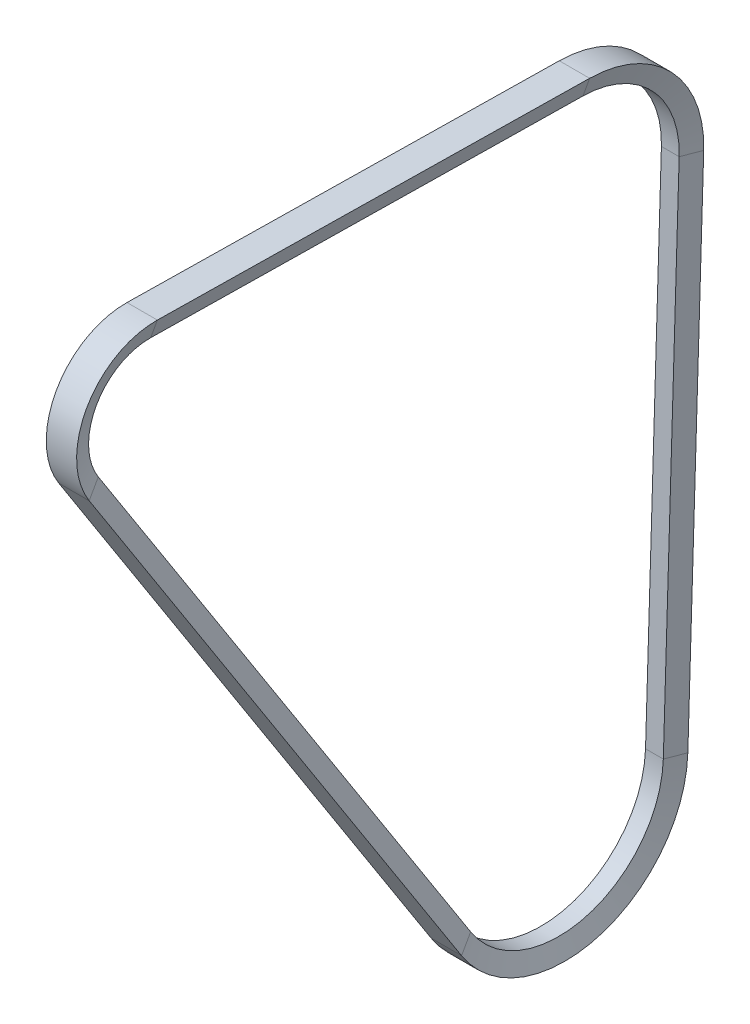
ISO-10303-21;
HEADER;
FILE_DESCRIPTION(('STEP AP214'),'2;1');
FILE_NAME('part.step','',(''),(''),'','','');
FILE_SCHEMA(('AUTOMOTIVE_DESIGN { 1 0 10303 214 1 1 1 1 }'));
ENDSEC;
DATA;
#1=APPLICATION_CONTEXT('core data for automotive mechanical design processes');
#2=APPLICATION_PROTOCOL_DEFINITION('international standard','automotive_design',2000,#1);
#3=PRODUCT_CONTEXT('',#1,'mechanical');
#4=PRODUCT('Part','Part','',(#3));
#5=PRODUCT_RELATED_PRODUCT_CATEGORY('part','',(#4));
#6=PRODUCT_DEFINITION_FORMATION('','',#4);
#7=PRODUCT_DEFINITION_CONTEXT('part definition',#1,'design');
#8=PRODUCT_DEFINITION('design','',#6,#7);
#9=PRODUCT_DEFINITION_SHAPE('','',#8);
#10=(LENGTH_UNIT() NAMED_UNIT(*) SI_UNIT(.MILLI.,.METRE.));
#11=(NAMED_UNIT(*) PLANE_ANGLE_UNIT() SI_UNIT($,.RADIAN.));
#12=(NAMED_UNIT(*) SI_UNIT($,.STERADIAN.) SOLID_ANGLE_UNIT());
#13=UNCERTAINTY_MEASURE_WITH_UNIT(LENGTH_MEASURE(1.E-05),#10,'distance_accuracy_value','');
#14=(GEOMETRIC_REPRESENTATION_CONTEXT(3) GLOBAL_UNCERTAINTY_ASSIGNED_CONTEXT((#13)) GLOBAL_UNIT_ASSIGNED_CONTEXT((#10,
#11,#12)) REPRESENTATION_CONTEXT('',''));
#15=CARTESIAN_POINT('',(0.,0.,0.));
#16=DIRECTION('',(0.,0.,1.));
#17=DIRECTION('',(1.,0.,0.));
#18=AXIS2_PLACEMENT_3D('',#15,#16,#17);
#19=CARTESIAN_POINT('',(-215.5,225.,-10.));
#20=DIRECTION('',(-1.,0.,0.));
#21=DIRECTION('',(0.,0.,1.));
#22=AXIS2_PLACEMENT_3D('',#19,#20,#21);
#23=CYLINDRICAL_SURFACE('',#22,42.8);
#24=DIRECTION('',(1.,0.,0.));
#25=VECTOR('',#24,1.);
#26=CARTESIAN_POINT('',(-212.6046209063,223.678862005,-52.77960488829));
#27=LINE('',#26,#25);
#28=CARTESIAN_POINT('',(-212.604620906297,223.678862004991,-52.7796048882876));
#29=VERTEX_POINT('',#28);
#30=CARTESIAN_POINT('',(-220.395379093704,223.678862005,-52.7796048882869));
#31=VERTEX_POINT('',#30);
#32=EDGE_CURVE('E107',#29,#31,#27,.F.);
#33=ORIENTED_EDGE('',*,*,#32,.F.);
#34=CARTESIAN_POINT('',(-212.604620906262,225.,-10.));
#35=DIRECTION('',(1.,0.,0.));
#36=DIRECTION('',(0.,0.999877205358888,-0.0156708073722922));
#37=AXIS2_PLACEMENT_3D('',#34,#35,#36);
#38=CIRCLE('',#37,42.8000000000309);
#39=CARTESIAN_POINT('',(-212.604620906296,267.794744389358,-10.67071055553));
#40=VERTEX_POINT('',#39);
#41=EDGE_CURVE('E105',#29,#40,#38,.T.);
#42=ORIENTED_EDGE('',*,*,#41,.T.);
#43=DIRECTION('',(1.,0.,0.));
#44=VECTOR('',#43,1.);
#45=CARTESIAN_POINT('',(-212.6046209063,267.794744389326,-10.6707105555288));
#46=LINE('',#45,#44);
#47=CARTESIAN_POINT('',(-220.39537909371,267.794744389362,-10.6707105555303));
#48=VERTEX_POINT('',#47);
#49=EDGE_CURVE('E19',#48,#40,#46,.T.);
#50=ORIENTED_EDGE('',*,*,#49,.F.);
#51=CARTESIAN_POINT('',(-220.395379093731,225.,-10.));
#52=DIRECTION('',(-1.,0.,0.));
#53=DIRECTION('',(0.,-0.999877205358888,0.015670807372298));
#54=AXIS2_PLACEMENT_3D('',#51,#52,#53);
#55=CIRCLE('',#54,42.8000000000423);
#56=EDGE_CURVE('E112',#48,#31,#55,.T.);
#57=ORIENTED_EDGE('',*,*,#56,.T.);
#58=EDGE_LOOP('',(#33,#42,#50,#57));
#59=FACE_BOUND('',#58,.T.);
#60=ADVANCED_FACE('F16',(#59),#23,.F.);
#61=CARTESIAN_POINT('',(-212.6046209063,270.7632481306,178.7349246749));
#62=DIRECTION('',(0.,-0.999877205358888,0.0156708073722898));
#63=DIRECTION('',(0.,-0.0156708073722898,-0.999877205358888));
#64=AXIS2_PLACEMENT_3D('',#61,#62,#63);
#65=PLANE('',#64);
#66=DIRECTION('',(1.18536617893384E-13,-0.015670807371941,-0.999877205358894));
#67=VECTOR('',#66,1.);
#68=CARTESIAN_POINT('',(-212.604620906325,270.763248130609,178.7349246749));
#69=LINE('',#68,#67);
#70=CARTESIAN_POINT('',(-212.604620906316,270.763248130611,178.734924674897));
#71=VERTEX_POINT('',#70);
#72=EDGE_CURVE('E118',#71,#40,#69,.T.);
#73=ORIENTED_EDGE('',*,*,#72,.F.);
#74=DIRECTION('',(-1.,0.,0.));
#75=VECTOR('',#74,1.);
#76=CARTESIAN_POINT('',(-215.5,270.763248130679,178.734924674899));
#77=LINE('',#76,#75);
#78=CARTESIAN_POINT('',(-220.3953790937,270.763248130633,178.734924674898));
#79=VERTEX_POINT('',#78);
#80=EDGE_CURVE('E167',#71,#79,#77,.T.);
#81=ORIENTED_EDGE('',*,*,#80,.T.);
#82=DIRECTION('',(1.18683140288802E-13,0.0156708073719407,0.999877205358894));
#83=VECTOR('',#82,1.);
#84=CARTESIAN_POINT('',(-220.395379093722,267.794744389392,-10.6707105555299));
#85=LINE('',#84,#83);
#86=EDGE_CURVE('E121',#48,#79,#85,.T.);
#87=ORIENTED_EDGE('',*,*,#86,.F.);
#88=ORIENTED_EDGE('',*,*,#49,.T.);
#89=EDGE_LOOP('',(#73,#81,#87,#88));
#90=FACE_BOUND('',#89,.T.);
#91=ADVANCED_FACE('F116',(#90),#65,.T.);
#92=CARTESIAN_POINT('',(-212.6046209063,223.678862005,-52.77960488829));
#93=DIRECTION('',(0.,0.0308677101643709,0.999523478698329));
#94=DIRECTION('',(0.,-0.999523478698329,0.0308677101643709));
#95=AXIS2_PLACEMENT_3D('',#92,#93,#94);
#96=PLANE('',#95);
#97=DIRECTION('',(0.,-0.999523478698329,0.0308677101643649));
#98=VECTOR('',#97,1.);
#99=CARTESIAN_POINT('',(-212.604620906317,223.678862005,-52.7796048882959));
#100=LINE('',#99,#98);
#101=CARTESIAN_POINT('',(-212.604620906296,-1.41528451103633,-45.8281514983268));
#102=VERTEX_POINT('',#101);
#103=EDGE_CURVE('E146',#29,#102,#100,.T.);
#104=ORIENTED_EDGE('',*,*,#103,.F.);
#105=ORIENTED_EDGE('',*,*,#32,.T.);
#106=DIRECTION('',(0.,0.999523478698329,-0.0308677101643649));
#107=VECTOR('',#106,1.);
#108=CARTESIAN_POINT('',(-220.3953790937,-1.41528451103601,-45.82815149832));
#109=LINE('',#108,#107);
#110=CARTESIAN_POINT('',(-220.395379093707,-1.41528451103626,-45.8281514983325));
#111=VERTEX_POINT('',#110);
#112=EDGE_CURVE('E143',#111,#31,#109,.T.);
#113=ORIENTED_EDGE('',*,*,#112,.F.);
#114=DIRECTION('',(-1.,0.,0.));
#115=VECTOR('',#114,1.);
#116=CARTESIAN_POINT('',(-215.5,-1.41528451103593,-45.8281514983184));
#117=LINE('',#116,#115);
#118=EDGE_CURVE('E165',#111,#102,#117,.F.);
#119=ORIENTED_EDGE('',*,*,#118,.T.);
#120=EDGE_LOOP('',(#104,#105,#113,#119));
#121=FACE_BOUND('',#120,.T.);
#122=ADVANCED_FACE('F141',(#121),#96,.T.);
#123=CARTESIAN_POINT('',(-209.850000000017,225.,-10.));
#124=DIRECTION('',(1.,0.,0.));
#125=DIRECTION('',(0.,0.,-1.));
#126=AXIS2_PLACEMENT_3D('',#123,#124,#125);
#127=CONICAL_SURFACE('',#126,50.7999999998629,1.23918376891562);
#128=DIRECTION('',(-0.325568154457151,0.0291859933566546,0.94506801585661));
#129=VECTOR('',#128,1.);
#130=CARTESIAN_POINT('',(-209.85,223.4319203236,-60.77579271788));
#131=LINE('',#130,#129);
#132=CARTESIAN_POINT('',(-209.84999999998,223.431920323601,-60.7757927178324));
#133=VERTEX_POINT('',#132);
#134=EDGE_CURVE('E159',#133,#29,#131,.T.);
#135=ORIENTED_EDGE('',*,*,#134,.F.);
#136=CARTESIAN_POINT('',(-209.85,225.,-10.));
#137=DIRECTION('',(-1.,0.,0.));
#138=DIRECTION('',(0.,0.,1.));
#139=AXIS2_PLACEMENT_3D('',#136,#137,#138);
#140=CIRCLE('',#139,50.8);
#141=CARTESIAN_POINT('',(-209.849999999982,275.793762032201,-10.7960770145113));
#142=VERTEX_POINT('',#141);
#143=EDGE_CURVE('E127',#142,#133,#140,.T.);
#144=ORIENTED_EDGE('',*,*,#143,.F.);
#145=DIRECTION('',(0.32556815445719,0.945402470985145,-0.0148170394654759));
#146=VECTOR('',#145,1.);
#147=CARTESIAN_POINT('',(-212.604620906302,267.794744389401,-10.67071055553));
#148=LINE('',#147,#146);
#149=EDGE_CURVE('E124',#40,#142,#148,.T.);
#150=ORIENTED_EDGE('',*,*,#149,.F.);
#151=ORIENTED_EDGE('',*,*,#41,.F.);
#152=EDGE_LOOP('',(#135,#144,#150,#151));
#153=FACE_BOUND('',#152,.T.);
#154=ADVANCED_FACE('F125',(#153),#127,.F.);
#155=CARTESIAN_POINT('',(-223.149999999976,225.,-10.));
#156=DIRECTION('',(-1.,0.,0.));
#157=DIRECTION('',(0.,0.,1.));
#158=AXIS2_PLACEMENT_3D('',#155,#156,#157);
#159=CONICAL_SURFACE('',#158,50.7999999998743,1.23918376891561);
#160=DIRECTION('',(-0.325568154457151,-0.0291859933566546,-0.94506801585661));
#161=VECTOR('',#160,1.);
#162=CARTESIAN_POINT('',(-220.3953790937,223.678862005,-52.77960488829));
#163=LINE('',#162,#161);
#164=CARTESIAN_POINT('',(-223.15000000002,223.431920323647,-60.7757927178593));
#165=VERTEX_POINT('',#164);
#166=EDGE_CURVE('E149',#31,#165,#163,.T.);
#167=ORIENTED_EDGE('',*,*,#166,.F.);
#168=ORIENTED_EDGE('',*,*,#56,.F.);
#169=DIRECTION('',(0.325568154457187,-0.945402470985146,0.0148170394654661));
#170=VECTOR('',#169,1.);
#171=CARTESIAN_POINT('',(-223.150000000016,275.793762032194,-10.7960770145099));
#172=LINE('',#171,#170);
#173=CARTESIAN_POINT('',(-223.150000000018,275.793762032203,-10.7960770145104));
#174=VERTEX_POINT('',#173);
#175=EDGE_CURVE('E130',#174,#48,#172,.T.);
#176=ORIENTED_EDGE('',*,*,#175,.F.);
#177=CARTESIAN_POINT('',(-223.15,225.,-10.));
#178=DIRECTION('',(-1.,0.,0.));
#179=DIRECTION('',(0.,0.,1.));
#180=AXIS2_PLACEMENT_3D('',#177,#178,#179);
#181=CIRCLE('',#180,50.8);
#182=EDGE_CURVE('E152',#165,#174,#181,.F.);
#183=ORIENTED_EDGE('',*,*,#182,.F.);
#184=EDGE_LOOP('',(#167,#168,#176,#183));
#185=FACE_BOUND('',#184,.T.);
#186=ADVANCED_FACE('F150',(#185),#159,.F.);
#187=CARTESIAN_POINT('',(-209.85,278.7622657735,178.6095582159));
#188=DIRECTION('',(0.945518575599307,-0.325528176432502,0.00510191583504904));
#189=DIRECTION('',(0.325532413190402,0.945530881548791,0.));
#190=AXIS2_PLACEMENT_3D('',#187,#188,#189);
#191=PLANE('',#190);
#192=DIRECTION('',(0.,0.0156708073722898,0.999877205358888));
#193=VECTOR('',#192,1.);
#194=CARTESIAN_POINT('',(-209.85,278.7622657735,178.6095582159));
#195=LINE('',#194,#193);
#196=CARTESIAN_POINT('',(-209.849999999997,278.762265773527,178.609558215901));
#197=VERTEX_POINT('',#196);
#198=EDGE_CURVE('E188',#197,#142,#195,.F.);
#199=ORIENTED_EDGE('',*,*,#198,.F.);
#200=DIRECTION('',(-0.325568154457378,-0.945402470985096,0.0148170394644727));
#201=VECTOR('',#200,1.);
#202=CARTESIAN_POINT('',(203865.894965586,592884.982859277,-9109.14885887035));
#203=LINE('',#202,#201);
#204=EDGE_CURVE('E134',#197,#71,#203,.T.);
#205=ORIENTED_EDGE('',*,*,#204,.T.);
#206=ORIENTED_EDGE('',*,*,#72,.T.);
#207=ORIENTED_EDGE('',*,*,#149,.T.);
#208=EDGE_LOOP('',(#199,#205,#206,#207));
#209=FACE_BOUND('',#208,.T.);
#210=ADVANCED_FACE('F132',(#209),#191,.T.);
#211=CARTESIAN_POINT('',(-220.3953790937,270.7632481306,178.7349246749));
#212=DIRECTION('',(-0.945518575599307,-0.325528176432502,0.00510191583504904));
#213=DIRECTION('',(0.325532413190402,-0.945530881548791,0.));
#214=AXIS2_PLACEMENT_3D('',#211,#212,#213);
#215=PLANE('',#214);
#216=ORIENTED_EDGE('',*,*,#86,.T.);
#217=DIRECTION('',(0.325568154457378,-0.945402470985074,0.0148170394658881));
#218=VECTOR('',#217,1.);
#219=CARTESIAN_POINT('',(-204445.494351263,593310.686109309,-9115.82079266471));
#220=LINE('',#219,#218);
#221=CARTESIAN_POINT('',(-223.150000000009,278.762265773498,178.6095582159));
#222=VERTEX_POINT('',#221);
#223=EDGE_CURVE('E195',#79,#222,#220,.F.);
#224=ORIENTED_EDGE('',*,*,#223,.T.);
#225=DIRECTION('',(0.,0.0156708073722898,0.999877205358888));
#226=VECTOR('',#225,1.);
#227=CARTESIAN_POINT('',(-223.15,278.7622657735,178.6095582159));
#228=LINE('',#227,#226);
#229=EDGE_CURVE('E174',#174,#222,#228,.T.);
#230=ORIENTED_EDGE('',*,*,#229,.F.);
#231=ORIENTED_EDGE('',*,*,#175,.T.);
#232=EDGE_LOOP('',(#216,#224,#230,#231));
#233=FACE_BOUND('',#232,.T.);
#234=ADVANCED_FACE('F171',(#233),#215,.T.);
#235=CARTESIAN_POINT('',(-215.5,243.9365427109,179.1553724367));
#236=DIRECTION('',(-1.,0.,0.));
#237=DIRECTION('',(0.,0.,1.));
#238=AXIS2_PLACEMENT_3D('',#235,#236,#237);
#239=CYLINDRICAL_SURFACE('',#238,26.83);
#240=ORIENTED_EDGE('',*,*,#80,.F.);
#241=CARTESIAN_POINT('',(-212.604620906376,243.9365427109,179.1553724367));
#242=DIRECTION('',(1.,0.,0.));
#243=DIRECTION('',(0.,-0.540120024150354,0.841587998673829));
#244=AXIS2_PLACEMENT_3D('',#241,#242,#243);
#245=CIRCLE('',#244,26.8299999998904);
#246=CARTESIAN_POINT('',(-212.604620906314,229.445122462912,201.73517844109));
#247=VERTEX_POINT('',#246);
#248=EDGE_CURVE('E184',#71,#247,#245,.T.);
#249=ORIENTED_EDGE('',*,*,#248,.T.);
#250=DIRECTION('',(1.,0.,0.));
#251=VECTOR('',#250,1.);
#252=CARTESIAN_POINT('',(-212.6046209063,229.445122462897,201.735178441105));
#253=LINE('',#252,#251);
#254=CARTESIAN_POINT('',(-220.395379093698,229.445122462854,201.735178441123));
#255=VERTEX_POINT('',#254);
#256=EDGE_CURVE('E197',#255,#247,#253,.T.);
#257=ORIENTED_EDGE('',*,*,#256,.F.);
#258=CARTESIAN_POINT('',(-220.395379093702,243.9365427109,179.1553724367));
#259=DIRECTION('',(-1.,0.,0.));
#260=DIRECTION('',(0.,0.540120024151957,-0.8415879986728));
#261=AXIS2_PLACEMENT_3D('',#258,#259,#260);
#262=CIRCLE('',#261,26.830000000067);
#263=EDGE_CURVE('E192',#255,#79,#262,.T.);
#264=ORIENTED_EDGE('',*,*,#263,.T.);
#265=EDGE_LOOP('',(#240,#249,#257,#264));
#266=FACE_BOUND('',#265,.T.);
#267=ADVANCED_FACE('F298',(#266),#239,.F.);
#268=CARTESIAN_POINT('',(-215.5,0.,0.));
#269=DIRECTION('',(-1.,0.,0.));
#270=DIRECTION('',(0.,0.,1.));
#271=AXIS2_PLACEMENT_3D('',#268,#269,#270);
#272=CYLINDRICAL_SURFACE('',#271,45.85);
#273=DIRECTION('',(1.,0.,0.));
#274=VECTOR('',#273,1.);
#275=CARTESIAN_POINT('',(-212.6046209063,-24.76450310736,38.58680973915));
#276=LINE('',#275,#274);
#277=CARTESIAN_POINT('',(-212.604620906294,-24.7645031073667,38.5868097391614));
#278=VERTEX_POINT('',#277);
#279=CARTESIAN_POINT('',(-220.395379093707,-24.7645031073663,38.5868097391608));
#280=VERTEX_POINT('',#279);
#281=EDGE_CURVE('E200',#278,#280,#276,.F.);
#282=ORIENTED_EDGE('',*,*,#281,.F.);
#283=CARTESIAN_POINT('',(-212.604620906234,0.,0.));
#284=DIRECTION('',(1.,0.,0.));
#285=DIRECTION('',(0.,-0.030867710164381,-0.999523478698328));
#286=AXIS2_PLACEMENT_3D('',#283,#284,#285);
#287=CIRCLE('',#286,45.8500000000513);
#288=EDGE_CURVE('E205',#278,#102,#287,.T.);
#289=ORIENTED_EDGE('',*,*,#288,.T.);
#290=ORIENTED_EDGE('',*,*,#118,.F.);
#291=CARTESIAN_POINT('',(-220.395379093759,0.,0.));
#292=DIRECTION('',(-1.,0.,0.));
#293=DIRECTION('',(0.,0.030867710164381,0.999523478698328));
#294=AXIS2_PLACEMENT_3D('',#291,#292,#293);
#295=CIRCLE('',#294,45.8500000000513);
#296=EDGE_CURVE('E209',#111,#280,#295,.T.);
#297=ORIENTED_EDGE('',*,*,#296,.T.);
#298=EDGE_LOOP('',(#282,#289,#290,#297));
#299=FACE_BOUND('',#298,.T.);
#300=ADVANCED_FACE('F281',(#299),#272,.F.);
#301=CARTESIAN_POINT('',(-209.85,223.4319203236,-60.77579271788));
#302=DIRECTION('',(0.945518575599319,0.0100495434305302,0.325413014296406));
#303=DIRECTION('',(0.32542944781203,0.,-0.945566324747639));
#304=AXIS2_PLACEMENT_3D('',#301,#302,#303);
#305=PLANE('',#304);
#306=DIRECTION('',(0.,0.999523478698329,-0.0308677101643709));
#307=VECTOR('',#306,1.);
#308=CARTESIAN_POINT('',(-209.85,223.4319203236,-60.77579271788));
#309=LINE('',#308,#307);
#310=CARTESIAN_POINT('',(-209.849999999985,-1.66222619235122,-53.8243393279));
#311=VERTEX_POINT('',#310);
#312=EDGE_CURVE('E211',#133,#311,#309,.F.);
#313=ORIENTED_EDGE('',*,*,#312,.F.);
#314=ORIENTED_EDGE('',*,*,#134,.T.);
#315=ORIENTED_EDGE('',*,*,#103,.T.);
#316=DIRECTION('',(-0.325568154457378,0.0291859933466262,0.945068015856842));
#317=VECTOR('',#316,1.);
#318=CARTESIAN_POINT('',(171673.001665587,-15410.3307228763,-499000.));
#319=LINE('',#318,#317);
#320=EDGE_CURVE('E203',#102,#311,#319,.F.);
#321=ORIENTED_EDGE('',*,*,#320,.T.);
#322=EDGE_LOOP('',(#313,#314,#315,#321));
#323=FACE_BOUND('',#322,.T.);
#324=ADVANCED_FACE('F279',(#323),#305,.T.);
#325=CARTESIAN_POINT('',(-220.3953790937,223.678862005,-52.77960488829));
#326=DIRECTION('',(-0.945518575599319,0.0100495434305302,0.325413014296406));
#327=DIRECTION('',(0.32542944781203,0.,0.945566324747639));
#328=AXIS2_PLACEMENT_3D('',#325,#326,#327);
#329=PLANE('',#328);
#330=ORIENTED_EDGE('',*,*,#112,.T.);
#331=ORIENTED_EDGE('',*,*,#166,.T.);
#332=DIRECTION('',(0.,0.999523478698329,-0.0308677101643709));
#333=VECTOR('',#332,1.);
#334=CARTESIAN_POINT('',(-223.15,223.4319203236,-60.77579271788));
#335=LINE('',#334,#333);
#336=CARTESIAN_POINT('',(-223.150000000022,-1.66222619235113,-53.8243393279112));
#337=VERTEX_POINT('',#336);
#338=EDGE_CURVE('E214',#337,#165,#335,.T.);
#339=ORIENTED_EDGE('',*,*,#338,.F.);
#340=DIRECTION('',(0.325568154457378,0.0291859933466101,0.945068015856842));
#341=VECTOR('',#340,1.);
#342=CARTESIAN_POINT('',(-172106.001665587,-15410.3307228678,-499000.));
#343=LINE('',#342,#341);
#344=EDGE_CURVE('E157',#337,#111,#343,.T.);
#345=ORIENTED_EDGE('',*,*,#344,.T.);
#346=EDGE_LOOP('',(#330,#331,#339,#345));
#347=FACE_BOUND('',#346,.T.);
#348=ADVANCED_FACE('F156',(#347),#329,.T.);
#349=CARTESIAN_POINT('',(-215.5,225.,-10.));
#350=DIRECTION('',(-1.,0.,0.));
#351=DIRECTION('',(0.,0.,1.));
#352=AXIS2_PLACEMENT_3D('',#349,#350,#351);
#353=CYLINDRICAL_SURFACE('',#352,50.8);
#354=ORIENTED_EDGE('',*,*,#182,.T.);
#355=DIRECTION('',(1.,0.,0.));
#356=VECTOR('',#355,1.);
#357=CARTESIAN_POINT('',(-223.15,275.793762032227,-10.7960770145104));
#358=LINE('',#357,#356);
#359=EDGE_CURVE('E178',#142,#174,#358,.F.);
#360=ORIENTED_EDGE('',*,*,#359,.F.);
#361=ORIENTED_EDGE('',*,*,#143,.T.);
#362=DIRECTION('',(1.,0.,0.));
#363=VECTOR('',#362,1.);
#364=CARTESIAN_POINT('',(-223.15,223.4319203236,-60.77579271788));
#365=LINE('',#364,#363);
#366=EDGE_CURVE('E181',#165,#133,#365,.T.);
#367=ORIENTED_EDGE('',*,*,#366,.F.);
#368=EDGE_LOOP('',(#354,#360,#361,#367));
#369=FACE_BOUND('',#368,.T.);
#370=ADVANCED_FACE('F177',(#369),#353,.T.);
#371=CARTESIAN_POINT('',(-209.849999999989,243.9365427109,179.1553724367));
#372=DIRECTION('',(1.,0.,0.));
#373=DIRECTION('',(0.,0.,-1.));
#374=AXIS2_PLACEMENT_3D('',#371,#372,#373);
#375=CONICAL_SURFACE('',#374,34.8300000000686,1.23918376891503);
#376=ORIENTED_EDGE('',*,*,#204,.F.);
#377=CARTESIAN_POINT('',(-209.85,243.9365427109,179.1553724367));
#378=DIRECTION('',(-1.,0.,0.));
#379=DIRECTION('',(0.,0.,1.));
#380=AXIS2_PLACEMENT_3D('',#377,#378,#379);
#381=CIRCLE('',#380,34.83);
#382=CARTESIAN_POINT('',(-209.849999999994,225.124162269656,208.467882430523));
#383=VERTEX_POINT('',#382);
#384=EDGE_CURVE('E226',#383,#197,#381,.T.);
#385=ORIENTED_EDGE('',*,*,#384,.F.);
#386=DIRECTION('',(0.325568154457161,-0.510693515894945,0.795737085742658));
#387=VECTOR('',#386,1.);
#388=CARTESIAN_POINT('',(-212.604620906333,229.445122462894,201.73517844111));
#389=LINE('',#388,#387);
#390=EDGE_CURVE('E220',#247,#383,#389,.T.);
#391=ORIENTED_EDGE('',*,*,#390,.F.);
#392=ORIENTED_EDGE('',*,*,#248,.F.);
#393=EDGE_LOOP('',(#376,#385,#391,#392));
#394=FACE_BOUND('',#393,.T.);
#395=ADVANCED_FACE('F299',(#394),#375,.F.);
#396=CARTESIAN_POINT('',(-223.15,278.7622657735,178.6095582159));
#397=DIRECTION('',(0.,0.999877205358888,-0.0156708073722898));
#398=DIRECTION('',(0.,0.0156708073722898,0.999877205358888));
#399=AXIS2_PLACEMENT_3D('',#396,#397,#398);
#400=PLANE('',#399);
#401=ORIENTED_EDGE('',*,*,#229,.T.);
#402=DIRECTION('',(-1.,0.,0.));
#403=VECTOR('',#402,1.);
#404=CARTESIAN_POINT('',(-215.5,278.76226577355,178.609558215899));
#405=LINE('',#404,#403);
#406=EDGE_CURVE('E229',#197,#222,#405,.T.);
#407=ORIENTED_EDGE('',*,*,#406,.F.);
#408=ORIENTED_EDGE('',*,*,#198,.T.);
#409=ORIENTED_EDGE('',*,*,#359,.T.);
#410=EDGE_LOOP('',(#401,#407,#408,#409));
#411=FACE_BOUND('',#410,.T.);
#412=ADVANCED_FACE('F301',(#411),#400,.T.);
#413=CARTESIAN_POINT('',(-223.149999999976,243.9365427109,179.1553724367));
#414=DIRECTION('',(-1.,0.,0.));
#415=DIRECTION('',(0.,-1.,0.));
#416=AXIS2_PLACEMENT_3D('',#413,#414,#415);
#417=CONICAL_SURFACE('',#416,34.8299999999139,1.23918376891499);
#418=ORIENTED_EDGE('',*,*,#223,.F.);
#419=ORIENTED_EDGE('',*,*,#263,.F.);
#420=DIRECTION('',(0.325568154457161,0.510693515894943,-0.795737085742659));
#421=VECTOR('',#420,1.);
#422=CARTESIAN_POINT('',(-223.150000000017,225.124162269603,208.467882430495));
#423=LINE('',#422,#421);
#424=CARTESIAN_POINT('',(-223.14999999999,225.124162269604,208.46788243043));
#425=VERTEX_POINT('',#424);
#426=EDGE_CURVE('E235',#425,#255,#423,.T.);
#427=ORIENTED_EDGE('',*,*,#426,.F.);
#428=CARTESIAN_POINT('',(-223.15,243.9365427109,179.1553724367));
#429=DIRECTION('',(-1.,0.,0.));
#430=DIRECTION('',(0.,0.,1.));
#431=AXIS2_PLACEMENT_3D('',#428,#429,#430);
#432=CIRCLE('',#431,34.83);
#433=EDGE_CURVE('E232',#222,#425,#432,.F.);
#434=ORIENTED_EDGE('',*,*,#433,.F.);
#435=EDGE_LOOP('',(#418,#419,#427,#434));
#436=FACE_BOUND('',#435,.T.);
#437=ADVANCED_FACE('F293',(#436),#417,.F.);
#438=CARTESIAN_POINT('',(-212.6046209063,-24.76450310736,38.58680973915));
#439=DIRECTION('',(0.,0.5401200241518,-0.841587998672901));
#440=DIRECTION('',(0.,0.841587998672901,0.5401200241518));
#441=AXIS2_PLACEMENT_3D('',#438,#439,#440);
#442=PLANE('',#441);
#443=DIRECTION('',(0.,0.841587998672902,0.540120024151799));
#444=VECTOR('',#443,1.);
#445=CARTESIAN_POINT('',(-212.604620906317,-24.7645031073631,38.5868097391548));
#446=LINE('',#445,#444);
#447=EDGE_CURVE('E217',#278,#247,#446,.T.);
#448=ORIENTED_EDGE('',*,*,#447,.F.);
#449=ORIENTED_EDGE('',*,*,#281,.T.);
#450=DIRECTION('',(0.,-0.841587998672902,-0.540120024151799));
#451=VECTOR('',#450,1.);
#452=CARTESIAN_POINT('',(-220.395379093683,229.445122462897,201.735178441105));
#453=LINE('',#452,#451);
#454=EDGE_CURVE('E238',#255,#280,#453,.T.);
#455=ORIENTED_EDGE('',*,*,#454,.F.);
#456=ORIENTED_EDGE('',*,*,#256,.T.);
#457=EDGE_LOOP('',(#448,#449,#455,#456));
#458=FACE_BOUND('',#457,.T.);
#459=ADVANCED_FACE('F297',(#458),#442,.T.);
#460=CARTESIAN_POINT('',(-209.849999999989,0.,0.));
#461=DIRECTION('',(1.,0.,0.));
#462=DIRECTION('',(0.,0.,-1.));
#463=AXIS2_PLACEMENT_3D('',#460,#461,#462);
#464=CONICAL_SURFACE('',#463,53.8499999998703,1.23918376891709);
#465=DIRECTION('',(-0.325568154457162,0.510693515887944,-0.79573708574715));
#466=VECTOR('',#465,1.);
#467=CARTESIAN_POINT('',(-209.85,-29.08546330057,45.31951372854));
#468=LINE('',#467,#466);
#469=CARTESIAN_POINT('',(-209.849999999966,-29.0854633005795,45.3195137285416));
#470=VERTEX_POINT('',#469);
#471=EDGE_CURVE('E223',#470,#278,#468,.T.);
#472=ORIENTED_EDGE('',*,*,#471,.F.);
#473=CARTESIAN_POINT('',(-209.85,0.,0.));
#474=DIRECTION('',(-1.,0.,0.));
#475=DIRECTION('',(0.,0.,1.));
#476=AXIS2_PLACEMENT_3D('',#473,#474,#475);
#477=CIRCLE('',#476,53.85);
#478=EDGE_CURVE('E243',#311,#470,#477,.T.);
#479=ORIENTED_EDGE('',*,*,#478,.F.);
#480=ORIENTED_EDGE('',*,*,#320,.F.);
#481=ORIENTED_EDGE('',*,*,#288,.F.);
#482=EDGE_LOOP('',(#472,#479,#480,#481));
#483=FACE_BOUND('',#482,.T.);
#484=ADVANCED_FACE('F272',(#483),#464,.F.);
#485=CARTESIAN_POINT('',(-223.150000000004,0.,0.));
#486=DIRECTION('',(-1.,0.,0.));
#487=DIRECTION('',(0.,0.,1.));
#488=AXIS2_PLACEMENT_3D('',#485,#486,#487);
#489=CONICAL_SURFACE('',#488,53.8499999998703,1.23918376891709);
#490=DIRECTION('',(-0.325568154457162,-0.510693515887944,0.79573708574715));
#491=VECTOR('',#490,1.);
#492=CARTESIAN_POINT('',(-220.3953790937,-24.76450310736,38.58680973915));
#493=LINE('',#492,#491);
#494=CARTESIAN_POINT('',(-223.150000000035,-29.0854633005788,45.3195137285404));
#495=VERTEX_POINT('',#494);
#496=EDGE_CURVE('E241',#280,#495,#493,.T.);
#497=ORIENTED_EDGE('',*,*,#496,.F.);
#498=ORIENTED_EDGE('',*,*,#296,.F.);
#499=ORIENTED_EDGE('',*,*,#344,.F.);
#500=CARTESIAN_POINT('',(-223.15,0.,0.));
#501=DIRECTION('',(-1.,0.,0.));
#502=DIRECTION('',(0.,0.,1.));
#503=AXIS2_PLACEMENT_3D('',#500,#501,#502);
#504=CIRCLE('',#503,53.85);
#505=EDGE_CURVE('E34',#495,#337,#504,.F.);
#506=ORIENTED_EDGE('',*,*,#505,.F.);
#507=EDGE_LOOP('',(#497,#498,#499,#506));
#508=FACE_BOUND('',#507,.T.);
#509=ADVANCED_FACE('F326',(#508),#489,.F.);
#510=CARTESIAN_POINT('',(-223.15,223.4319203236,-60.77579271788));
#511=DIRECTION('',(0.,-0.0308677101643709,-0.999523478698329));
#512=DIRECTION('',(0.,0.999523478698329,-0.0308677101643709));
#513=AXIS2_PLACEMENT_3D('',#510,#511,#512);
#514=PLANE('',#513);
#515=ORIENTED_EDGE('',*,*,#338,.T.);
#516=ORIENTED_EDGE('',*,*,#366,.T.);
#517=ORIENTED_EDGE('',*,*,#312,.T.);
#518=DIRECTION('',(-1.,0.,0.));
#519=VECTOR('',#518,1.);
#520=CARTESIAN_POINT('',(-215.5,-1.66222619235115,-53.824339327905));
#521=LINE('',#520,#519);
#522=EDGE_CURVE('E247',#337,#311,#521,.F.);
#523=ORIENTED_EDGE('',*,*,#522,.F.);
#524=EDGE_LOOP('',(#515,#516,#517,#523));
#525=FACE_BOUND('',#524,.T.);
#526=ADVANCED_FACE('F277',(#525),#514,.T.);
#527=CARTESIAN_POINT('',(-209.85,-29.08546330057,45.31951372854));
#528=DIRECTION('',(0.945518575599315,0.175845879448503,-0.273994251541204));
#529=DIRECTION('',(-0.278331290579866,0.,-0.960485134025585));
#530=AXIS2_PLACEMENT_3D('',#527,#528,#529);
#531=PLANE('',#530);
#532=DIRECTION('',(0.,-0.841587998672901,-0.5401200241518));
#533=VECTOR('',#532,1.);
#534=CARTESIAN_POINT('',(-209.85,-29.08546330057,45.31951372854));
#535=LINE('',#534,#533);
#536=EDGE_CURVE('E250',#470,#383,#535,.F.);
#537=ORIENTED_EDGE('',*,*,#536,.F.);
#538=ORIENTED_EDGE('',*,*,#471,.T.);
#539=ORIENTED_EDGE('',*,*,#447,.T.);
#540=ORIENTED_EDGE('',*,*,#390,.T.);
#541=EDGE_LOOP('',(#537,#538,#539,#540));
#542=FACE_BOUND('',#541,.T.);
#543=ADVANCED_FACE('F284',(#542),#531,.T.);
#544=CARTESIAN_POINT('',(-215.5,243.9365427109,179.1553724367));
#545=DIRECTION('',(-1.,0.,0.));
#546=DIRECTION('',(0.,0.,1.));
#547=AXIS2_PLACEMENT_3D('',#544,#545,#546);
#548=CYLINDRICAL_SURFACE('',#547,34.83);
#549=ORIENTED_EDGE('',*,*,#433,.T.);
#550=DIRECTION('',(1.,0.,0.));
#551=VECTOR('',#550,1.);
#552=CARTESIAN_POINT('',(-223.15,225.124162269627,208.467882430457));
#553=LINE('',#552,#551);
#554=EDGE_CURVE('E253',#383,#425,#553,.F.);
#555=ORIENTED_EDGE('',*,*,#554,.F.);
#556=ORIENTED_EDGE('',*,*,#384,.T.);
#557=ORIENTED_EDGE('',*,*,#406,.T.);
#558=EDGE_LOOP('',(#549,#555,#556,#557));
#559=FACE_BOUND('',#558,.T.);
#560=ADVANCED_FACE('F289',(#559),#548,.T.);
#561=CARTESIAN_POINT('',(-220.3953790937,-24.76450310736,38.58680973915));
#562=DIRECTION('',(-0.945518575599315,0.175845879448503,-0.273994251541204));
#563=DIRECTION('',(-0.278331290579866,0.,0.960485134025585));
#564=AXIS2_PLACEMENT_3D('',#561,#562,#563);
#565=PLANE('',#564);
#566=ORIENTED_EDGE('',*,*,#454,.T.);
#567=ORIENTED_EDGE('',*,*,#496,.T.);
#568=DIRECTION('',(0.,-0.841587998672901,-0.5401200241518));
#569=VECTOR('',#568,1.);
#570=CARTESIAN_POINT('',(-223.15,-29.08546330057,45.31951372854));
#571=LINE('',#570,#569);
#572=EDGE_CURVE('E25',#425,#495,#571,.T.);
#573=ORIENTED_EDGE('',*,*,#572,.F.);
#574=ORIENTED_EDGE('',*,*,#426,.T.);
#575=EDGE_LOOP('',(#566,#567,#573,#574));
#576=FACE_BOUND('',#575,.T.);
#577=ADVANCED_FACE('F263',(#576),#565,.T.);
#578=CARTESIAN_POINT('',(-215.5,0.,0.));
#579=DIRECTION('',(-1.,0.,0.));
#580=DIRECTION('',(0.,0.,1.));
#581=AXIS2_PLACEMENT_3D('',#578,#579,#580);
#582=CYLINDRICAL_SURFACE('',#581,53.85);
#583=ORIENTED_EDGE('',*,*,#505,.T.);
#584=ORIENTED_EDGE('',*,*,#522,.T.);
#585=ORIENTED_EDGE('',*,*,#478,.T.);
#586=DIRECTION('',(1.,0.,0.));
#587=VECTOR('',#586,1.);
#588=CARTESIAN_POINT('',(-223.15,-29.08546330057,45.31951372854));
#589=LINE('',#588,#587);
#590=EDGE_CURVE('E11',#495,#470,#589,.T.);
#591=ORIENTED_EDGE('',*,*,#590,.F.);
#592=EDGE_LOOP('',(#583,#584,#585,#591));
#593=FACE_BOUND('',#592,.T.);
#594=ADVANCED_FACE('F267',(#593),#582,.T.);
#595=CARTESIAN_POINT('',(-223.15,-29.08546330057,45.31951372854));
#596=DIRECTION('',(0.,-0.5401200241518,0.841587998672901));
#597=DIRECTION('',(0.,-0.841587998672901,-0.5401200241518));
#598=AXIS2_PLACEMENT_3D('',#595,#596,#597);
#599=PLANE('',#598);
#600=ORIENTED_EDGE('',*,*,#572,.T.);
#601=ORIENTED_EDGE('',*,*,#590,.T.);
#602=ORIENTED_EDGE('',*,*,#536,.T.);
#603=ORIENTED_EDGE('',*,*,#554,.T.);
#604=EDGE_LOOP('',(#600,#601,#602,#603));
#605=FACE_BOUND('',#604,.T.);
#606=ADVANCED_FACE('F259',(#605),#599,.T.);
#607=CLOSED_SHELL('',(#60,#91,#122,#154,#186,#210,#234,#267,#300,#324,#348,#370,#395,#412,#437,
#459,#484,#509,#526,#543,#560,#577,#594,#606));
#608=MANIFOLD_SOLID_BREP('B1',#607);
#609=ADVANCED_BREP_SHAPE_REPRESENTATION('',(#18,#608),#14);
#610=SHAPE_DEFINITION_REPRESENTATION(#9,#609);
ENDSEC;
END-ISO-10303-21;
